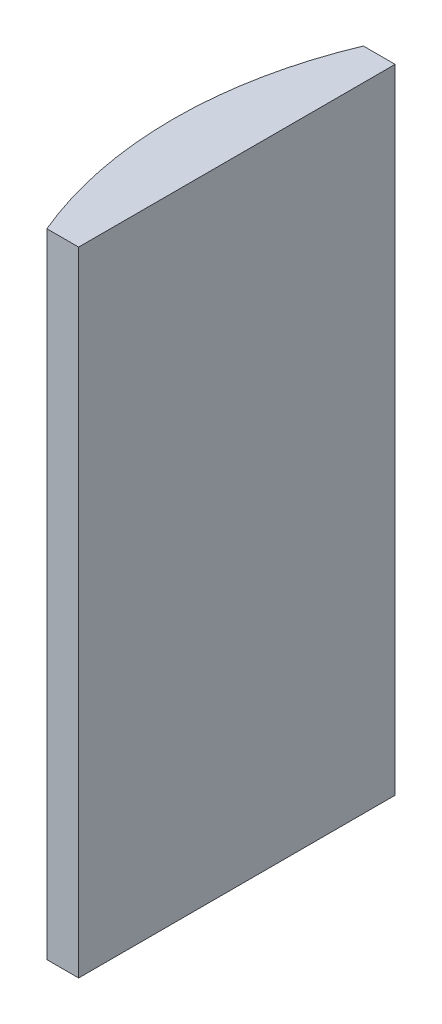
ISO-10303-21;
HEADER;
FILE_DESCRIPTION(('STEP AP214'),'2;1');
FILE_NAME('part.step','',(''),(''),'','','');
FILE_SCHEMA(('AUTOMOTIVE_DESIGN { 1 0 10303 214 1 1 1 1 }'));
ENDSEC;
DATA;
#1=APPLICATION_CONTEXT('core data for automotive mechanical design processes');
#2=APPLICATION_PROTOCOL_DEFINITION('international standard','automotive_design',2000,#1);
#3=PRODUCT_CONTEXT('',#1,'mechanical');
#4=PRODUCT('Part','Part','',(#3));
#5=PRODUCT_RELATED_PRODUCT_CATEGORY('part','',(#4));
#6=PRODUCT_DEFINITION_FORMATION('','',#4);
#7=PRODUCT_DEFINITION_CONTEXT('part definition',#1,'design');
#8=PRODUCT_DEFINITION('design','',#6,#7);
#9=PRODUCT_DEFINITION_SHAPE('','',#8);
#10=(LENGTH_UNIT() NAMED_UNIT(*) SI_UNIT(.MILLI.,.METRE.));
#11=(NAMED_UNIT(*) PLANE_ANGLE_UNIT() SI_UNIT($,.RADIAN.));
#12=(NAMED_UNIT(*) SI_UNIT($,.STERADIAN.) SOLID_ANGLE_UNIT());
#13=UNCERTAINTY_MEASURE_WITH_UNIT(LENGTH_MEASURE(1.E-05),#10,'distance_accuracy_value','');
#14=(GEOMETRIC_REPRESENTATION_CONTEXT(3) GLOBAL_UNCERTAINTY_ASSIGNED_CONTEXT((#13)) GLOBAL_UNIT_ASSIGNED_CONTEXT((#10,
#11,#12)) REPRESENTATION_CONTEXT('',''));
#15=CARTESIAN_POINT('',(0.,0.,0.));
#16=DIRECTION('',(0.,0.,1.));
#17=DIRECTION('',(1.,0.,0.));
#18=AXIS2_PLACEMENT_3D('',#15,#16,#17);
#19=CARTESIAN_POINT('',(4.35520433485127,40.,0.));
#20=DIRECTION('',(0.,-1.,0.));
#21=DIRECTION('',(0.,0.,-1.));
#22=AXIS2_PLACEMENT_3D('',#19,#20,#21);
#23=CYLINDRICAL_SURFACE('',#22,25.85);
#24=CARTESIAN_POINT('',(4.35520433485127,0.,0.));
#25=DIRECTION('',(0.,1.,0.));
#26=DIRECTION('',(0.,0.,1.));
#27=AXIS2_PLACEMENT_3D('',#24,#25,#26);
#28=CIRCLE('',#27,25.85);
#29=CARTESIAN_POINT('',(-19.4822137300315,0.,-10.));
#30=VERTEX_POINT('',#29);
#31=CARTESIAN_POINT('',(-19.4822137300315,0.,10.));
#32=VERTEX_POINT('',#31);
#33=EDGE_CURVE('E100',#30,#32,#28,.T.);
#34=ORIENTED_EDGE('',*,*,#33,.T.);
#35=DIRECTION('',(0.,-1.,0.));
#36=VECTOR('',#35,1.);
#37=CARTESIAN_POINT('',(-19.4822137300315,40.,10.));
#38=LINE('',#37,#36);
#39=CARTESIAN_POINT('',(-19.4822137300315,40.,10.));
#40=VERTEX_POINT('',#39);
#41=EDGE_CURVE('E11',#40,#32,#38,.T.);
#42=ORIENTED_EDGE('',*,*,#41,.F.);
#43=CARTESIAN_POINT('',(4.35520433485127,40.,0.));
#44=DIRECTION('',(0.,1.,0.));
#45=DIRECTION('',(0.,0.,1.));
#46=AXIS2_PLACEMENT_3D('',#43,#44,#45);
#47=CIRCLE('',#46,25.85);
#48=CARTESIAN_POINT('',(-19.4822137300315,40.,-10.));
#49=VERTEX_POINT('',#48);
#50=EDGE_CURVE('E88',#49,#40,#47,.T.);
#51=ORIENTED_EDGE('',*,*,#50,.F.);
#52=DIRECTION('',(0.,-1.,0.));
#53=VECTOR('',#52,1.);
#54=CARTESIAN_POINT('',(-19.4822137300315,40.,-10.));
#55=LINE('',#54,#53);
#56=EDGE_CURVE('E96',#49,#30,#55,.T.);
#57=ORIENTED_EDGE('',*,*,#56,.T.);
#58=EDGE_LOOP('',(#34,#42,#51,#57));
#59=FACE_BOUND('',#58,.T.);
#60=ADVANCED_FACE('F37',(#59),#23,.T.);
#61=CARTESIAN_POINT('',(-19.4822137300315,40.,10.));
#62=DIRECTION('',(0.,0.,-1.));
#63=DIRECTION('',(-1.,0.,0.));
#64=AXIS2_PLACEMENT_3D('',#61,#62,#63);
#65=PLANE('',#64);
#66=DIRECTION('',(1.,0.,0.));
#67=VECTOR('',#66,1.);
#68=CARTESIAN_POINT('',(-19.4822137300315,0.,10.));
#69=LINE('',#68,#67);
#70=CARTESIAN_POINT('',(-17.4747956651487,0.,10.));
#71=VERTEX_POINT('',#70);
#72=EDGE_CURVE('E92',#32,#71,#69,.T.);
#73=ORIENTED_EDGE('',*,*,#72,.T.);
#74=DIRECTION('',(0.,-1.,0.));
#75=VECTOR('',#74,1.);
#76=CARTESIAN_POINT('',(-17.4747956651487,40.,10.));
#77=LINE('',#76,#75);
#78=CARTESIAN_POINT('',(-17.4747956651487,40.,10.));
#79=VERTEX_POINT('',#78);
#80=EDGE_CURVE('E45',#79,#71,#77,.T.);
#81=ORIENTED_EDGE('',*,*,#80,.F.);
#82=DIRECTION('',(1.,0.,0.));
#83=VECTOR('',#82,1.);
#84=CARTESIAN_POINT('',(-19.4822137300315,40.,10.));
#85=LINE('',#84,#83);
#86=EDGE_CURVE('E83',#40,#79,#85,.T.);
#87=ORIENTED_EDGE('',*,*,#86,.F.);
#88=ORIENTED_EDGE('',*,*,#41,.T.);
#89=EDGE_LOOP('',(#73,#81,#87,#88));
#90=FACE_BOUND('',#89,.T.);
#91=ADVANCED_FACE('F91',(#90),#65,.F.);
#92=CARTESIAN_POINT('',(-17.4747956651487,40.,-10.));
#93=DIRECTION('',(-1.,0.,0.));
#94=DIRECTION('',(0.,0.,1.));
#95=AXIS2_PLACEMENT_3D('',#92,#93,#94);
#96=PLANE('',#95);
#97=DIRECTION('',(0.,0.,-1.));
#98=VECTOR('',#97,1.);
#99=CARTESIAN_POINT('',(-17.4747956651487,0.,-10.));
#100=LINE('',#99,#98);
#101=CARTESIAN_POINT('',(-17.4747956651487,0.,-10.));
#102=VERTEX_POINT('',#101);
#103=EDGE_CURVE('E70',#71,#102,#100,.T.);
#104=ORIENTED_EDGE('',*,*,#103,.T.);
#105=DIRECTION('',(0.,-1.,0.));
#106=VECTOR('',#105,1.);
#107=CARTESIAN_POINT('',(-17.4747956651487,40.,-10.));
#108=LINE('',#107,#106);
#109=CARTESIAN_POINT('',(-17.4747956651487,40.,-10.));
#110=VERTEX_POINT('',#109);
#111=EDGE_CURVE('E93',#110,#102,#108,.T.);
#112=ORIENTED_EDGE('',*,*,#111,.F.);
#113=DIRECTION('',(0.,0.,-1.));
#114=VECTOR('',#113,1.);
#115=CARTESIAN_POINT('',(-17.4747956651487,40.,-10.));
#116=LINE('',#115,#114);
#117=EDGE_CURVE('E86',#79,#110,#116,.T.);
#118=ORIENTED_EDGE('',*,*,#117,.F.);
#119=ORIENTED_EDGE('',*,*,#80,.T.);
#120=EDGE_LOOP('',(#104,#112,#118,#119));
#121=FACE_BOUND('',#120,.T.);
#122=ADVANCED_FACE('F94',(#121),#96,.F.);
#123=CARTESIAN_POINT('',(-19.4822137300315,40.,-10.));
#124=DIRECTION('',(0.,0.,1.));
#125=DIRECTION('',(1.,0.,0.));
#126=AXIS2_PLACEMENT_3D('',#123,#124,#125);
#127=PLANE('',#126);
#128=DIRECTION('',(-1.,0.,0.));
#129=VECTOR('',#128,1.);
#130=CARTESIAN_POINT('',(-19.4822137300315,0.,-10.));
#131=LINE('',#130,#129);
#132=EDGE_CURVE('E76',#102,#30,#131,.T.);
#133=ORIENTED_EDGE('',*,*,#132,.T.);
#134=ORIENTED_EDGE('',*,*,#56,.F.);
#135=DIRECTION('',(-1.,0.,0.));
#136=VECTOR('',#135,1.);
#137=CARTESIAN_POINT('',(-19.4822137300315,40.,-10.));
#138=LINE('',#137,#136);
#139=EDGE_CURVE('E53',#110,#49,#138,.T.);
#140=ORIENTED_EDGE('',*,*,#139,.F.);
#141=ORIENTED_EDGE('',*,*,#111,.T.);
#142=EDGE_LOOP('',(#133,#134,#140,#141));
#143=FACE_BOUND('',#142,.T.);
#144=ADVANCED_FACE('F107',(#143),#127,.F.);
#145=CARTESIAN_POINT('',(4.35520433485127,40.,0.));
#146=DIRECTION('',(0.,1.,0.));
#147=DIRECTION('',(0.,0.,1.));
#148=AXIS2_PLACEMENT_3D('',#145,#146,#147);
#149=PLANE('',#148);
#150=ORIENTED_EDGE('',*,*,#50,.T.);
#151=ORIENTED_EDGE('',*,*,#86,.T.);
#152=ORIENTED_EDGE('',*,*,#117,.T.);
#153=ORIENTED_EDGE('',*,*,#139,.T.);
#154=EDGE_LOOP('',(#150,#151,#152,#153));
#155=FACE_BOUND('',#154,.T.);
#156=ADVANCED_FACE('F84',(#155),#149,.T.);
#157=CARTESIAN_POINT('',(4.35520433485127,0.,0.));
#158=DIRECTION('',(0.,1.,0.));
#159=DIRECTION('',(0.,0.,1.));
#160=AXIS2_PLACEMENT_3D('',#157,#158,#159);
#161=PLANE('',#160);
#162=ORIENTED_EDGE('',*,*,#33,.F.);
#163=ORIENTED_EDGE('',*,*,#132,.F.);
#164=ORIENTED_EDGE('',*,*,#103,.F.);
#165=ORIENTED_EDGE('',*,*,#72,.F.);
#166=EDGE_LOOP('',(#162,#163,#164,#165));
#167=FACE_BOUND('',#166,.T.);
#168=ADVANCED_FACE('F110',(#167),#161,.F.);
#169=CLOSED_SHELL('',(#60,#91,#122,#144,#156,#168));
#170=MANIFOLD_SOLID_BREP('B2',#169);
#171=ADVANCED_BREP_SHAPE_REPRESENTATION('',(#18,#170),#14);
#172=SHAPE_DEFINITION_REPRESENTATION(#9,#171);
ENDSEC;
END-ISO-10303-21;
